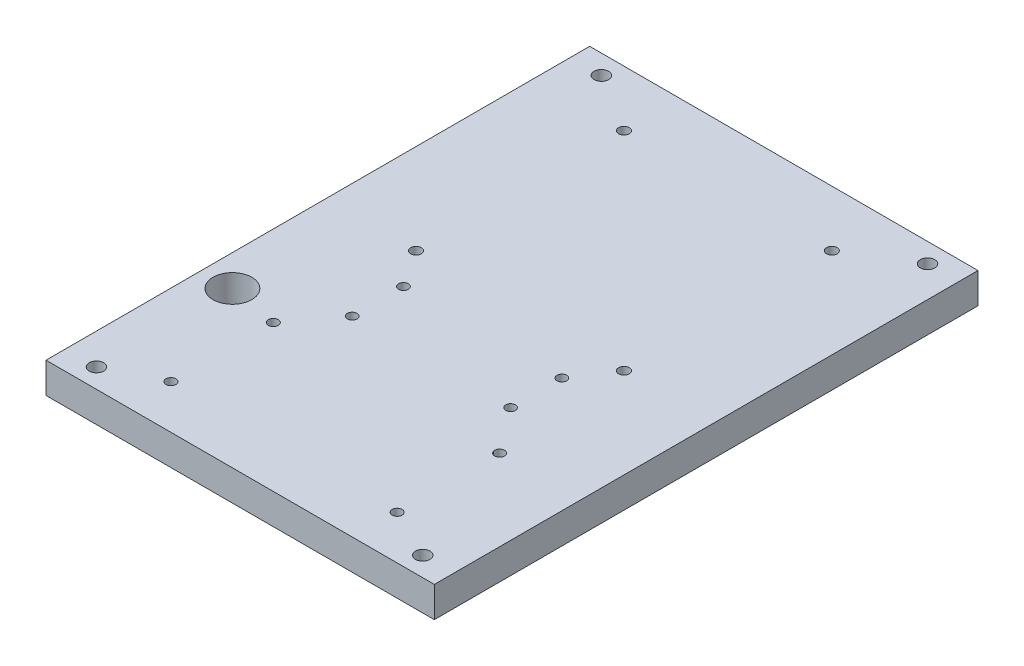
ISO-10303-21;
HEADER;
FILE_DESCRIPTION(('STEP AP214'),'2;1');
FILE_NAME('part.step','',(''),(''),'','','');
FILE_SCHEMA(('AUTOMOTIVE_DESIGN { 1 0 10303 214 1 1 1 1 }'));
ENDSEC;
DATA;
#1=APPLICATION_CONTEXT('core data for automotive mechanical design processes');
#2=APPLICATION_PROTOCOL_DEFINITION('international standard','automotive_design',2000,#1);
#3=PRODUCT_CONTEXT('',#1,'mechanical');
#4=PRODUCT('Part','Part','',(#3));
#5=PRODUCT_RELATED_PRODUCT_CATEGORY('part','',(#4));
#6=PRODUCT_DEFINITION_FORMATION('','',#4);
#7=PRODUCT_DEFINITION_CONTEXT('part definition',#1,'design');
#8=PRODUCT_DEFINITION('design','',#6,#7);
#9=PRODUCT_DEFINITION_SHAPE('','',#8);
#10=(LENGTH_UNIT() NAMED_UNIT(*) SI_UNIT(.MILLI.,.METRE.));
#11=(NAMED_UNIT(*) PLANE_ANGLE_UNIT() SI_UNIT($,.RADIAN.));
#12=(NAMED_UNIT(*) SI_UNIT($,.STERADIAN.) SOLID_ANGLE_UNIT());
#13=UNCERTAINTY_MEASURE_WITH_UNIT(LENGTH_MEASURE(1.E-05),#10,'distance_accuracy_value','');
#14=(GEOMETRIC_REPRESENTATION_CONTEXT(3) GLOBAL_UNCERTAINTY_ASSIGNED_CONTEXT((#13)) GLOBAL_UNIT_ASSIGNED_CONTEXT((#10,
#11,#12)) REPRESENTATION_CONTEXT('',''));
#15=CARTESIAN_POINT('',(0.,0.,0.));
#16=DIRECTION('',(0.,0.,1.));
#17=DIRECTION('',(1.,0.,0.));
#18=AXIS2_PLACEMENT_3D('',#15,#16,#17);
#19=CARTESIAN_POINT('',(0.,10.,0.));
#20=DIRECTION('',(0.,1.,0.));
#21=DIRECTION('',(0.,0.,1.));
#22=AXIS2_PLACEMENT_3D('',#19,#20,#21);
#23=PLANE('',#22);
#24=CARTESIAN_POINT('',(25.908,10.,9.5937055453349));
#25=DIRECTION('',(0.,1.,0.));
#26=DIRECTION('',(0.,0.,1.));
#27=AXIS2_PLACEMENT_3D('',#24,#25,#26);
#28=CIRCLE('',#27,1.5875);
#29=CARTESIAN_POINT('',(25.908,10.,11.1812055453349));
#30=VERTEX_POINT('',#29);
#31=EDGE_CURVE('E207',#30,#30,#28,.T.);
#32=ORIENTED_EDGE('',*,*,#31,.F.);
#33=EDGE_LOOP('',(#32));
#34=FACE_BOUND('',#33,.T.);
#35=CARTESIAN_POINT('',(25.908,10.,26.3577055453349));
#36=DIRECTION('',(0.,1.,0.));
#37=DIRECTION('',(0.,0.,1.));
#38=AXIS2_PLACEMENT_3D('',#35,#36,#37);
#39=CIRCLE('',#38,1.5875);
#40=CARTESIAN_POINT('',(25.908,10.,27.9452055453349));
#41=VERTEX_POINT('',#40);
#42=EDGE_CURVE('E201',#41,#41,#39,.T.);
#43=ORIENTED_EDGE('',*,*,#42,.F.);
#44=EDGE_LOOP('',(#43));
#45=FACE_BOUND('',#44,.T.);
#46=CARTESIAN_POINT('',(-25.908,10.,26.3577055453349));
#47=DIRECTION('',(0.,1.,0.));
#48=DIRECTION('',(0.,0.,1.));
#49=AXIS2_PLACEMENT_3D('',#46,#47,#48);
#50=CIRCLE('',#49,1.58750000000001);
#51=CARTESIAN_POINT('',(-25.908,10.,27.9452055453349));
#52=VERTEX_POINT('',#51);
#53=EDGE_CURVE('E195',#52,#52,#50,.T.);
#54=ORIENTED_EDGE('',*,*,#53,.F.);
#55=EDGE_LOOP('',(#54));
#56=FACE_BOUND('',#55,.T.);
#57=CARTESIAN_POINT('',(-25.908,10.,9.5937055453349));
#58=DIRECTION('',(0.,1.,0.));
#59=DIRECTION('',(0.,0.,1.));
#60=AXIS2_PLACEMENT_3D('',#57,#58,#59);
#61=CIRCLE('',#60,1.58750000000001);
#62=CARTESIAN_POINT('',(-25.908,10.,11.1812055453349));
#63=VERTEX_POINT('',#62);
#64=EDGE_CURVE('E192',#63,#63,#61,.T.);
#65=ORIENTED_EDGE('',*,*,#64,.F.);
#66=EDGE_LOOP('',(#65));
#67=FACE_BOUND('',#66,.T.);
#68=CARTESIAN_POINT('',(-34.,10.,-2.60371481104785));
#69=DIRECTION('',(0.,1.,0.));
#70=DIRECTION('',(0.,0.,1.));
#71=AXIS2_PLACEMENT_3D('',#68,#69,#70);
#72=CIRCLE('',#71,1.75000000000001);
#73=CARTESIAN_POINT('',(-34.,10.,-0.853714811047836));
#74=VERTEX_POINT('',#73);
#75=EDGE_CURVE('E186',#74,#74,#72,.T.);
#76=ORIENTED_EDGE('',*,*,#75,.F.);
#77=EDGE_LOOP('',(#76));
#78=FACE_BOUND('',#77,.T.);
#79=CARTESIAN_POINT('',(34.,10.,-2.60371481104786));
#80=DIRECTION('',(0.,1.,0.));
#81=DIRECTION('',(0.,0.,1.));
#82=AXIS2_PLACEMENT_3D('',#79,#80,#81);
#83=CIRCLE('',#82,1.75000000000001);
#84=CARTESIAN_POINT('',(34.,10.,-0.85371481104785));
#85=VERTEX_POINT('',#84);
#86=EDGE_CURVE('E180',#85,#85,#83,.T.);
#87=ORIENTED_EDGE('',*,*,#86,.F.);
#88=EDGE_LOOP('',(#87));
#89=FACE_BOUND('',#88,.T.);
#90=CARTESIAN_POINT('',(-34.,10.,-70.6037148110478));
#91=DIRECTION('',(0.,1.,0.));
#92=DIRECTION('',(0.,0.,1.));
#93=AXIS2_PLACEMENT_3D('',#90,#91,#92);
#94=CIRCLE('',#93,1.75000000000001);
#95=CARTESIAN_POINT('',(-34.,10.,-68.8537148110478));
#96=VERTEX_POINT('',#95);
#97=EDGE_CURVE('E174',#96,#96,#94,.T.);
#98=ORIENTED_EDGE('',*,*,#97,.F.);
#99=EDGE_LOOP('',(#98));
#100=FACE_BOUND('',#99,.T.);
#101=CARTESIAN_POINT('',(34.,10.,-70.6037148110478));
#102=DIRECTION('',(0.,1.,0.));
#103=DIRECTION('',(0.,0.,1.));
#104=AXIS2_PLACEMENT_3D('',#101,#102,#103);
#105=CIRCLE('',#104,1.75000000000001);
#106=CARTESIAN_POINT('',(34.,10.,-68.8537148110478));
#107=VERTEX_POINT('',#106);
#108=EDGE_CURVE('E168',#107,#107,#105,.T.);
#109=ORIENTED_EDGE('',*,*,#108,.F.);
#110=EDGE_LOOP('',(#109));
#111=FACE_BOUND('',#110,.T.);
#112=CARTESIAN_POINT('',(37.,10.,41.0497834995753));
#113=DIRECTION('',(0.,1.,0.));
#114=DIRECTION('',(0.,0.,1.));
#115=AXIS2_PLACEMENT_3D('',#112,#113,#114);
#116=CIRCLE('',#115,1.62500000000003);
#117=CARTESIAN_POINT('',(37.,10.,42.6747834995753));
#118=VERTEX_POINT('',#117);
#119=EDGE_CURVE('E162',#118,#118,#116,.T.);
#120=ORIENTED_EDGE('',*,*,#119,.F.);
#121=EDGE_LOOP('',(#120));
#122=FACE_BOUND('',#121,.T.);
#123=CARTESIAN_POINT('',(-37.,10.,41.0497834995753));
#124=DIRECTION('',(0.,1.,0.));
#125=DIRECTION('',(0.,0.,1.));
#126=AXIS2_PLACEMENT_3D('',#123,#124,#125);
#127=CIRCLE('',#126,1.625);
#128=CARTESIAN_POINT('',(-37.,10.,42.6747834995753));
#129=VERTEX_POINT('',#128);
#130=EDGE_CURVE('E156',#129,#129,#127,.T.);
#131=ORIENTED_EDGE('',*,*,#130,.F.);
#132=EDGE_LOOP('',(#131));
#133=FACE_BOUND('',#132,.T.);
#134=CARTESIAN_POINT('',(-37.,10.,74.5497834995753));
#135=DIRECTION('',(0.,1.,0.));
#136=DIRECTION('',(0.,0.,1.));
#137=AXIS2_PLACEMENT_3D('',#134,#135,#136);
#138=CIRCLE('',#137,1.625);
#139=CARTESIAN_POINT('',(-37.,10.,76.1747834995753));
#140=VERTEX_POINT('',#139);
#141=EDGE_CURVE('E150',#140,#140,#138,.T.);
#142=ORIENTED_EDGE('',*,*,#141,.F.);
#143=EDGE_LOOP('',(#142));
#144=FACE_BOUND('',#143,.T.);
#145=CARTESIAN_POINT('',(37.,10.,74.5497834995753));
#146=DIRECTION('',(0.,1.,0.));
#147=DIRECTION('',(0.,0.,1.));
#148=AXIS2_PLACEMENT_3D('',#145,#146,#147);
#149=CIRCLE('',#148,1.625);
#150=CARTESIAN_POINT('',(37.,10.,76.1747834995753));
#151=VERTEX_POINT('',#150);
#152=EDGE_CURVE('E144',#151,#151,#149,.T.);
#153=ORIENTED_EDGE('',*,*,#152,.F.);
#154=EDGE_LOOP('',(#153));
#155=FACE_BOUND('',#154,.T.);
#156=CARTESIAN_POINT('',(-53.34,10.,82.55));
#157=DIRECTION('',(0.,1.,0.));
#158=DIRECTION('',(0.,0.,1.));
#159=AXIS2_PLACEMENT_3D('',#156,#157,#158);
#160=CIRCLE('',#159,2.37490000000001);
#161=CARTESIAN_POINT('',(-53.34,10.,84.9249));
#162=VERTEX_POINT('',#161);
#163=EDGE_CURVE('E129',#162,#162,#160,.T.);
#164=ORIENTED_EDGE('',*,*,#163,.F.);
#165=EDGE_LOOP('',(#164));
#166=FACE_BOUND('',#165,.T.);
#167=CARTESIAN_POINT('',(53.34,10.,-82.55));
#168=DIRECTION('',(0.,1.,0.));
#169=DIRECTION('',(0.,0.,1.));
#170=AXIS2_PLACEMENT_3D('',#167,#168,#169);
#171=CIRCLE('',#170,2.37490000000005);
#172=CARTESIAN_POINT('',(53.34,10.,-80.1751));
#173=VERTEX_POINT('',#172);
#174=EDGE_CURVE('E117',#173,#173,#171,.T.);
#175=ORIENTED_EDGE('',*,*,#174,.F.);
#176=EDGE_LOOP('',(#175));
#177=FACE_BOUND('',#176,.T.);
#178=DIRECTION('',(0.,0.,1.));
#179=VECTOR('',#178,1.);
#180=CARTESIAN_POINT('',(-63.5,10.,88.9));
#181=LINE('',#180,#179);
#182=CARTESIAN_POINT('',(-63.5,10.,-88.9));
#183=VERTEX_POINT('',#182);
#184=CARTESIAN_POINT('',(-63.5,10.,88.9));
#185=VERTEX_POINT('',#184);
#186=EDGE_CURVE('E87',#183,#185,#181,.T.);
#187=ORIENTED_EDGE('',*,*,#186,.T.);
#188=DIRECTION('',(1.,0.,0.));
#189=VECTOR('',#188,1.);
#190=CARTESIAN_POINT('',(63.5,10.,88.9));
#191=LINE('',#190,#189);
#192=CARTESIAN_POINT('',(63.5,10.,88.9));
#193=VERTEX_POINT('',#192);
#194=EDGE_CURVE('E82',#185,#193,#191,.T.);
#195=ORIENTED_EDGE('',*,*,#194,.T.);
#196=DIRECTION('',(0.,0.,-1.));
#197=VECTOR('',#196,1.);
#198=CARTESIAN_POINT('',(63.5,10.,88.9));
#199=LINE('',#198,#197);
#200=CARTESIAN_POINT('',(63.5,10.,-88.9));
#201=VERTEX_POINT('',#200);
#202=EDGE_CURVE('E85',#193,#201,#199,.T.);
#203=ORIENTED_EDGE('',*,*,#202,.T.);
#204=DIRECTION('',(-1.,0.,0.));
#205=VECTOR('',#204,1.);
#206=CARTESIAN_POINT('',(63.5,10.,-88.9));
#207=LINE('',#206,#205);
#208=EDGE_CURVE('E52',#201,#183,#207,.T.);
#209=ORIENTED_EDGE('',*,*,#208,.T.);
#210=EDGE_LOOP('',(#187,#195,#203,#209));
#211=FACE_BOUND('',#210,.T.);
#212=CARTESIAN_POINT('',(-53.34,10.,-82.55));
#213=DIRECTION('',(0.,1.,0.));
#214=DIRECTION('',(0.,0.,1.));
#215=AXIS2_PLACEMENT_3D('',#212,#213,#214);
#216=CIRCLE('',#215,2.37490000000002);
#217=CARTESIAN_POINT('',(-53.34,10.,-80.1751));
#218=VERTEX_POINT('',#217);
#219=EDGE_CURVE('E102',#218,#218,#216,.T.);
#220=ORIENTED_EDGE('',*,*,#219,.F.);
#221=EDGE_LOOP('',(#220));
#222=FACE_BOUND('',#221,.T.);
#223=CARTESIAN_POINT('',(53.34,10.,82.55));
#224=DIRECTION('',(0.,1.,0.));
#225=DIRECTION('',(0.,0.,1.));
#226=AXIS2_PLACEMENT_3D('',#223,#224,#225);
#227=CIRCLE('',#226,2.37490000000002);
#228=CARTESIAN_POINT('',(53.34,10.,84.9249));
#229=VERTEX_POINT('',#228);
#230=EDGE_CURVE('E123',#229,#229,#227,.T.);
#231=ORIENTED_EDGE('',*,*,#230,.F.);
#232=EDGE_LOOP('',(#231));
#233=FACE_BOUND('',#232,.T.);
#234=CARTESIAN_POINT('',(-53.34,10.,38.1));
#235=DIRECTION('',(0.,1.,0.));
#236=DIRECTION('',(0.,0.,1.));
#237=AXIS2_PLACEMENT_3D('',#234,#235,#236);
#238=CIRCLE('',#237,6.35);
#239=CARTESIAN_POINT('',(-53.34,10.,44.45));
#240=VERTEX_POINT('',#239);
#241=EDGE_CURVE('E135',#240,#240,#238,.T.);
#242=ORIENTED_EDGE('',*,*,#241,.F.);
#243=EDGE_LOOP('',(#242));
#244=FACE_BOUND('',#243,.T.);
#245=ADVANCED_FACE('F35',(#34,#45,#56,#67,#78,#89,#100,#111,#122,#133,#144,#155,#166,#177,#211,
#222,#233,#244),#23,.T.);
#246=CARTESIAN_POINT('',(0.,0.,0.));
#247=DIRECTION('',(0.,1.,0.));
#248=DIRECTION('',(0.,0.,1.));
#249=AXIS2_PLACEMENT_3D('',#246,#247,#248);
#250=PLANE('',#249);
#251=CARTESIAN_POINT('',(25.908,0.,9.5937055453349));
#252=DIRECTION('',(0.,1.,0.));
#253=DIRECTION('',(0.,0.,1.));
#254=AXIS2_PLACEMENT_3D('',#251,#252,#253);
#255=CIRCLE('',#254,1.5875);
#256=CARTESIAN_POINT('',(25.908,0.,11.1812055453349));
#257=VERTEX_POINT('',#256);
#258=EDGE_CURVE('E210',#257,#257,#255,.T.);
#259=ORIENTED_EDGE('',*,*,#258,.T.);
#260=EDGE_LOOP('',(#259));
#261=FACE_BOUND('',#260,.T.);
#262=CARTESIAN_POINT('',(25.908,0.,26.3577055453349));
#263=DIRECTION('',(0.,1.,0.));
#264=DIRECTION('',(0.,0.,1.));
#265=AXIS2_PLACEMENT_3D('',#262,#263,#264);
#266=CIRCLE('',#265,1.5875);
#267=CARTESIAN_POINT('',(25.908,0.,27.9452055453349));
#268=VERTEX_POINT('',#267);
#269=EDGE_CURVE('E204',#268,#268,#266,.T.);
#270=ORIENTED_EDGE('',*,*,#269,.T.);
#271=EDGE_LOOP('',(#270));
#272=FACE_BOUND('',#271,.T.);
#273=CARTESIAN_POINT('',(-25.908,0.,26.3577055453349));
#274=DIRECTION('',(0.,1.,0.));
#275=DIRECTION('',(0.,0.,1.));
#276=AXIS2_PLACEMENT_3D('',#273,#274,#275);
#277=CIRCLE('',#276,1.58750000000001);
#278=CARTESIAN_POINT('',(-25.908,0.,27.9452055453349));
#279=VERTEX_POINT('',#278);
#280=EDGE_CURVE('E198',#279,#279,#277,.T.);
#281=ORIENTED_EDGE('',*,*,#280,.T.);
#282=EDGE_LOOP('',(#281));
#283=FACE_BOUND('',#282,.T.);
#284=CARTESIAN_POINT('',(-25.908,0.,9.5937055453349));
#285=DIRECTION('',(0.,1.,0.));
#286=DIRECTION('',(0.,0.,1.));
#287=AXIS2_PLACEMENT_3D('',#284,#285,#286);
#288=CIRCLE('',#287,1.58750000000001);
#289=CARTESIAN_POINT('',(-25.908,0.,11.1812055453349));
#290=VERTEX_POINT('',#289);
#291=EDGE_CURVE('E189',#290,#290,#288,.T.);
#292=ORIENTED_EDGE('',*,*,#291,.T.);
#293=EDGE_LOOP('',(#292));
#294=FACE_BOUND('',#293,.T.);
#295=CARTESIAN_POINT('',(-34.,0.,-2.60371481104785));
#296=DIRECTION('',(0.,1.,0.));
#297=DIRECTION('',(0.,0.,1.));
#298=AXIS2_PLACEMENT_3D('',#295,#296,#297);
#299=CIRCLE('',#298,1.75000000000001);
#300=CARTESIAN_POINT('',(-34.,0.,-0.853714811047836));
#301=VERTEX_POINT('',#300);
#302=EDGE_CURVE('E183',#301,#301,#299,.T.);
#303=ORIENTED_EDGE('',*,*,#302,.T.);
#304=EDGE_LOOP('',(#303));
#305=FACE_BOUND('',#304,.T.);
#306=CARTESIAN_POINT('',(34.,0.,-2.60371481104786));
#307=DIRECTION('',(0.,1.,0.));
#308=DIRECTION('',(0.,0.,1.));
#309=AXIS2_PLACEMENT_3D('',#306,#307,#308);
#310=CIRCLE('',#309,1.75000000000001);
#311=CARTESIAN_POINT('',(34.,0.,-0.85371481104785));
#312=VERTEX_POINT('',#311);
#313=EDGE_CURVE('E177',#312,#312,#310,.T.);
#314=ORIENTED_EDGE('',*,*,#313,.T.);
#315=EDGE_LOOP('',(#314));
#316=FACE_BOUND('',#315,.T.);
#317=CARTESIAN_POINT('',(-34.,0.,-70.6037148110478));
#318=DIRECTION('',(0.,1.,0.));
#319=DIRECTION('',(0.,0.,1.));
#320=AXIS2_PLACEMENT_3D('',#317,#318,#319);
#321=CIRCLE('',#320,1.75000000000001);
#322=CARTESIAN_POINT('',(-34.,0.,-68.8537148110478));
#323=VERTEX_POINT('',#322);
#324=EDGE_CURVE('E171',#323,#323,#321,.T.);
#325=ORIENTED_EDGE('',*,*,#324,.T.);
#326=EDGE_LOOP('',(#325));
#327=FACE_BOUND('',#326,.T.);
#328=CARTESIAN_POINT('',(34.,0.,-70.6037148110478));
#329=DIRECTION('',(0.,1.,0.));
#330=DIRECTION('',(0.,0.,1.));
#331=AXIS2_PLACEMENT_3D('',#328,#329,#330);
#332=CIRCLE('',#331,1.75000000000001);
#333=CARTESIAN_POINT('',(34.,0.,-68.8537148110478));
#334=VERTEX_POINT('',#333);
#335=EDGE_CURVE('E165',#334,#334,#332,.T.);
#336=ORIENTED_EDGE('',*,*,#335,.T.);
#337=EDGE_LOOP('',(#336));
#338=FACE_BOUND('',#337,.T.);
#339=CARTESIAN_POINT('',(37.,0.,41.0497834995753));
#340=DIRECTION('',(0.,1.,0.));
#341=DIRECTION('',(0.,0.,1.));
#342=AXIS2_PLACEMENT_3D('',#339,#340,#341);
#343=CIRCLE('',#342,1.62500000000003);
#344=CARTESIAN_POINT('',(37.,0.,42.6747834995753));
#345=VERTEX_POINT('',#344);
#346=EDGE_CURVE('E159',#345,#345,#343,.T.);
#347=ORIENTED_EDGE('',*,*,#346,.T.);
#348=EDGE_LOOP('',(#347));
#349=FACE_BOUND('',#348,.T.);
#350=CARTESIAN_POINT('',(-37.,0.,41.0497834995753));
#351=DIRECTION('',(0.,1.,0.));
#352=DIRECTION('',(0.,0.,1.));
#353=AXIS2_PLACEMENT_3D('',#350,#351,#352);
#354=CIRCLE('',#353,1.625);
#355=CARTESIAN_POINT('',(-37.,0.,42.6747834995753));
#356=VERTEX_POINT('',#355);
#357=EDGE_CURVE('E153',#356,#356,#354,.T.);
#358=ORIENTED_EDGE('',*,*,#357,.T.);
#359=EDGE_LOOP('',(#358));
#360=FACE_BOUND('',#359,.T.);
#361=CARTESIAN_POINT('',(-37.,0.,74.5497834995753));
#362=DIRECTION('',(0.,1.,0.));
#363=DIRECTION('',(0.,0.,1.));
#364=AXIS2_PLACEMENT_3D('',#361,#362,#363);
#365=CIRCLE('',#364,1.625);
#366=CARTESIAN_POINT('',(-37.,0.,76.1747834995753));
#367=VERTEX_POINT('',#366);
#368=EDGE_CURVE('E147',#367,#367,#365,.T.);
#369=ORIENTED_EDGE('',*,*,#368,.T.);
#370=EDGE_LOOP('',(#369));
#371=FACE_BOUND('',#370,.T.);
#372=CARTESIAN_POINT('',(37.,0.,74.5497834995753));
#373=DIRECTION('',(0.,1.,0.));
#374=DIRECTION('',(0.,0.,1.));
#375=AXIS2_PLACEMENT_3D('',#372,#373,#374);
#376=CIRCLE('',#375,1.625);
#377=CARTESIAN_POINT('',(37.,0.,76.1747834995753));
#378=VERTEX_POINT('',#377);
#379=EDGE_CURVE('E141',#378,#378,#376,.T.);
#380=ORIENTED_EDGE('',*,*,#379,.T.);
#381=EDGE_LOOP('',(#380));
#382=FACE_BOUND('',#381,.T.);
#383=CARTESIAN_POINT('',(-53.34,0.,82.55));
#384=DIRECTION('',(0.,1.,0.));
#385=DIRECTION('',(0.,0.,1.));
#386=AXIS2_PLACEMENT_3D('',#383,#384,#385);
#387=CIRCLE('',#386,2.37490000000001);
#388=CARTESIAN_POINT('',(-53.34,0.,84.9249));
#389=VERTEX_POINT('',#388);
#390=EDGE_CURVE('E132',#389,#389,#387,.T.);
#391=ORIENTED_EDGE('',*,*,#390,.T.);
#392=EDGE_LOOP('',(#391));
#393=FACE_BOUND('',#392,.T.);
#394=CARTESIAN_POINT('',(53.34,0.,-82.55));
#395=DIRECTION('',(0.,1.,0.));
#396=DIRECTION('',(0.,0.,1.));
#397=AXIS2_PLACEMENT_3D('',#394,#395,#396);
#398=CIRCLE('',#397,2.37490000000005);
#399=CARTESIAN_POINT('',(53.34,0.,-80.1751));
#400=VERTEX_POINT('',#399);
#401=EDGE_CURVE('E120',#400,#400,#398,.T.);
#402=ORIENTED_EDGE('',*,*,#401,.T.);
#403=EDGE_LOOP('',(#402));
#404=FACE_BOUND('',#403,.T.);
#405=DIRECTION('',(0.,0.,1.));
#406=VECTOR('',#405,1.);
#407=CARTESIAN_POINT('',(-63.5,0.,88.9));
#408=LINE('',#407,#406);
#409=CARTESIAN_POINT('',(-63.5,0.,-88.9));
#410=VERTEX_POINT('',#409);
#411=CARTESIAN_POINT('',(-63.5,0.,88.9));
#412=VERTEX_POINT('',#411);
#413=EDGE_CURVE('E99',#410,#412,#408,.T.);
#414=ORIENTED_EDGE('',*,*,#413,.F.);
#415=DIRECTION('',(-1.,0.,0.));
#416=VECTOR('',#415,1.);
#417=CARTESIAN_POINT('',(63.5,0.,-88.9));
#418=LINE('',#417,#416);
#419=CARTESIAN_POINT('',(63.5,0.,-88.9));
#420=VERTEX_POINT('',#419);
#421=EDGE_CURVE('E75',#420,#410,#418,.T.);
#422=ORIENTED_EDGE('',*,*,#421,.F.);
#423=DIRECTION('',(0.,0.,-1.));
#424=VECTOR('',#423,1.);
#425=CARTESIAN_POINT('',(63.5,0.,88.9));
#426=LINE('',#425,#424);
#427=CARTESIAN_POINT('',(63.5,0.,88.9));
#428=VERTEX_POINT('',#427);
#429=EDGE_CURVE('E69',#428,#420,#426,.T.);
#430=ORIENTED_EDGE('',*,*,#429,.F.);
#431=DIRECTION('',(1.,0.,0.));
#432=VECTOR('',#431,1.);
#433=CARTESIAN_POINT('',(63.5,0.,88.9));
#434=LINE('',#433,#432);
#435=EDGE_CURVE('E91',#412,#428,#434,.T.);
#436=ORIENTED_EDGE('',*,*,#435,.F.);
#437=EDGE_LOOP('',(#414,#422,#430,#436));
#438=FACE_BOUND('',#437,.T.);
#439=CARTESIAN_POINT('',(-53.34,0.,-82.55));
#440=DIRECTION('',(0.,1.,0.));
#441=DIRECTION('',(0.,0.,1.));
#442=AXIS2_PLACEMENT_3D('',#439,#440,#441);
#443=CIRCLE('',#442,2.37490000000002);
#444=CARTESIAN_POINT('',(-53.34,0.,-80.1751));
#445=VERTEX_POINT('',#444);
#446=EDGE_CURVE('E114',#445,#445,#443,.T.);
#447=ORIENTED_EDGE('',*,*,#446,.T.);
#448=EDGE_LOOP('',(#447));
#449=FACE_BOUND('',#448,.T.);
#450=CARTESIAN_POINT('',(53.34,0.,82.55));
#451=DIRECTION('',(0.,1.,0.));
#452=DIRECTION('',(0.,0.,1.));
#453=AXIS2_PLACEMENT_3D('',#450,#451,#452);
#454=CIRCLE('',#453,2.37490000000002);
#455=CARTESIAN_POINT('',(53.34,0.,84.9249));
#456=VERTEX_POINT('',#455);
#457=EDGE_CURVE('E126',#456,#456,#454,.T.);
#458=ORIENTED_EDGE('',*,*,#457,.T.);
#459=EDGE_LOOP('',(#458));
#460=FACE_BOUND('',#459,.T.);
#461=CARTESIAN_POINT('',(-53.34,0.,38.1));
#462=DIRECTION('',(0.,1.,0.));
#463=DIRECTION('',(0.,0.,1.));
#464=AXIS2_PLACEMENT_3D('',#461,#462,#463);
#465=CIRCLE('',#464,6.35);
#466=CARTESIAN_POINT('',(-53.34,0.,44.45));
#467=VERTEX_POINT('',#466);
#468=EDGE_CURVE('E138',#467,#467,#465,.T.);
#469=ORIENTED_EDGE('',*,*,#468,.T.);
#470=EDGE_LOOP('',(#469));
#471=FACE_BOUND('',#470,.T.);
#472=ADVANCED_FACE('F110',(#261,#272,#283,#294,#305,#316,#327,#338,#349,#360,#371,#382,#393,
#404,#438,#449,#460,#471),#250,.F.);
#473=CARTESIAN_POINT('',(-63.5,10.,88.9));
#474=DIRECTION('',(1.,0.,0.));
#475=DIRECTION('',(0.,0.,-1.));
#476=AXIS2_PLACEMENT_3D('',#473,#474,#475);
#477=PLANE('',#476);
#478=ORIENTED_EDGE('',*,*,#413,.T.);
#479=DIRECTION('',(0.,-1.,0.));
#480=VECTOR('',#479,1.);
#481=CARTESIAN_POINT('',(-63.5,10.,88.9));
#482=LINE('',#481,#480);
#483=EDGE_CURVE('E11',#185,#412,#482,.T.);
#484=ORIENTED_EDGE('',*,*,#483,.F.);
#485=ORIENTED_EDGE('',*,*,#186,.F.);
#486=DIRECTION('',(0.,-1.,0.));
#487=VECTOR('',#486,1.);
#488=CARTESIAN_POINT('',(-63.5,10.,-88.9));
#489=LINE('',#488,#487);
#490=EDGE_CURVE('E95',#183,#410,#489,.T.);
#491=ORIENTED_EDGE('',*,*,#490,.T.);
#492=EDGE_LOOP('',(#478,#484,#485,#491));
#493=FACE_BOUND('',#492,.T.);
#494=ADVANCED_FACE('F37',(#493),#477,.F.);
#495=CARTESIAN_POINT('',(63.5,10.,88.9));
#496=DIRECTION('',(0.,0.,-1.));
#497=DIRECTION('',(-1.,0.,0.));
#498=AXIS2_PLACEMENT_3D('',#495,#496,#497);
#499=PLANE('',#498);
#500=ORIENTED_EDGE('',*,*,#435,.T.);
#501=DIRECTION('',(0.,-1.,0.));
#502=VECTOR('',#501,1.);
#503=CARTESIAN_POINT('',(63.5,10.,88.9));
#504=LINE('',#503,#502);
#505=EDGE_CURVE('E44',#193,#428,#504,.T.);
#506=ORIENTED_EDGE('',*,*,#505,.F.);
#507=ORIENTED_EDGE('',*,*,#194,.F.);
#508=ORIENTED_EDGE('',*,*,#483,.T.);
#509=EDGE_LOOP('',(#500,#506,#507,#508));
#510=FACE_BOUND('',#509,.T.);
#511=ADVANCED_FACE('F90',(#510),#499,.F.);
#512=CARTESIAN_POINT('',(63.5,10.,88.9));
#513=DIRECTION('',(-1.,0.,0.));
#514=DIRECTION('',(0.,0.,1.));
#515=AXIS2_PLACEMENT_3D('',#512,#513,#514);
#516=PLANE('',#515);
#517=ORIENTED_EDGE('',*,*,#429,.T.);
#518=DIRECTION('',(0.,-1.,0.));
#519=VECTOR('',#518,1.);
#520=CARTESIAN_POINT('',(63.5,10.,-88.9));
#521=LINE('',#520,#519);
#522=EDGE_CURVE('E92',#201,#420,#521,.T.);
#523=ORIENTED_EDGE('',*,*,#522,.F.);
#524=ORIENTED_EDGE('',*,*,#202,.F.);
#525=ORIENTED_EDGE('',*,*,#505,.T.);
#526=EDGE_LOOP('',(#517,#523,#524,#525));
#527=FACE_BOUND('',#526,.T.);
#528=ADVANCED_FACE('F93',(#527),#516,.F.);
#529=CARTESIAN_POINT('',(63.5,10.,-88.9));
#530=DIRECTION('',(0.,0.,1.));
#531=DIRECTION('',(1.,0.,0.));
#532=AXIS2_PLACEMENT_3D('',#529,#530,#531);
#533=PLANE('',#532);
#534=ORIENTED_EDGE('',*,*,#421,.T.);
#535=ORIENTED_EDGE('',*,*,#490,.F.);
#536=ORIENTED_EDGE('',*,*,#208,.F.);
#537=ORIENTED_EDGE('',*,*,#522,.T.);
#538=EDGE_LOOP('',(#534,#535,#536,#537));
#539=FACE_BOUND('',#538,.T.);
#540=ADVANCED_FACE('F107',(#539),#533,.F.);
#541=CARTESIAN_POINT('',(-53.34,10.,-82.55));
#542=DIRECTION('',(0.,-1.,0.));
#543=DIRECTION('',(0.,0.,-1.));
#544=AXIS2_PLACEMENT_3D('',#541,#542,#543);
#545=CYLINDRICAL_SURFACE('',#544,2.37490000000002);
#546=ORIENTED_EDGE('',*,*,#219,.T.);
#547=EDGE_LOOP('',(#546));
#548=FACE_BOUND('',#547,.T.);
#549=ORIENTED_EDGE('',*,*,#446,.F.);
#550=EDGE_LOOP('',(#549));
#551=FACE_BOUND('',#550,.T.);
#552=ADVANCED_FACE('F251',(#548,#551),#545,.F.);
#553=CARTESIAN_POINT('',(53.34,10.,-82.55));
#554=DIRECTION('',(0.,-1.,0.));
#555=DIRECTION('',(0.,0.,-1.));
#556=AXIS2_PLACEMENT_3D('',#553,#554,#555);
#557=CYLINDRICAL_SURFACE('',#556,2.37490000000005);
#558=ORIENTED_EDGE('',*,*,#174,.T.);
#559=EDGE_LOOP('',(#558));
#560=FACE_BOUND('',#559,.T.);
#561=ORIENTED_EDGE('',*,*,#401,.F.);
#562=EDGE_LOOP('',(#561));
#563=FACE_BOUND('',#562,.T.);
#564=ADVANCED_FACE('F247',(#560,#563),#557,.F.);
#565=CARTESIAN_POINT('',(53.34,10.,82.55));
#566=DIRECTION('',(0.,-1.,0.));
#567=DIRECTION('',(0.,0.,-1.));
#568=AXIS2_PLACEMENT_3D('',#565,#566,#567);
#569=CYLINDRICAL_SURFACE('',#568,2.37490000000002);
#570=ORIENTED_EDGE('',*,*,#230,.T.);
#571=EDGE_LOOP('',(#570));
#572=FACE_BOUND('',#571,.T.);
#573=ORIENTED_EDGE('',*,*,#457,.F.);
#574=EDGE_LOOP('',(#573));
#575=FACE_BOUND('',#574,.T.);
#576=ADVANCED_FACE('F250',(#572,#575),#569,.F.);
#577=CARTESIAN_POINT('',(-53.34,10.,82.55));
#578=DIRECTION('',(0.,-1.,0.));
#579=DIRECTION('',(0.,0.,-1.));
#580=AXIS2_PLACEMENT_3D('',#577,#578,#579);
#581=CYLINDRICAL_SURFACE('',#580,2.37490000000001);
#582=ORIENTED_EDGE('',*,*,#163,.T.);
#583=EDGE_LOOP('',(#582));
#584=FACE_BOUND('',#583,.T.);
#585=ORIENTED_EDGE('',*,*,#390,.F.);
#586=EDGE_LOOP('',(#585));
#587=FACE_BOUND('',#586,.T.);
#588=ADVANCED_FACE('F296',(#584,#587),#581,.F.);
#589=CARTESIAN_POINT('',(-53.34,10.,38.1));
#590=DIRECTION('',(0.,-1.,0.));
#591=DIRECTION('',(0.,0.,-1.));
#592=AXIS2_PLACEMENT_3D('',#589,#590,#591);
#593=CYLINDRICAL_SURFACE('',#592,6.35);
#594=ORIENTED_EDGE('',*,*,#241,.T.);
#595=EDGE_LOOP('',(#594));
#596=FACE_BOUND('',#595,.T.);
#597=ORIENTED_EDGE('',*,*,#468,.F.);
#598=EDGE_LOOP('',(#597));
#599=FACE_BOUND('',#598,.T.);
#600=ADVANCED_FACE('F304',(#596,#599),#593,.F.);
#601=CARTESIAN_POINT('',(37.,0.,74.5497834995753));
#602=DIRECTION('',(0.,1.,0.));
#603=DIRECTION('',(0.,0.,1.));
#604=AXIS2_PLACEMENT_3D('',#601,#602,#603);
#605=CYLINDRICAL_SURFACE('',#604,1.625);
#606=ORIENTED_EDGE('',*,*,#379,.F.);
#607=EDGE_LOOP('',(#606));
#608=FACE_BOUND('',#607,.T.);
#609=ORIENTED_EDGE('',*,*,#152,.T.);
#610=EDGE_LOOP('',(#609));
#611=FACE_BOUND('',#610,.T.);
#612=ADVANCED_FACE('F312',(#608,#611),#605,.F.);
#613=CARTESIAN_POINT('',(-37.,0.,74.5497834995753));
#614=DIRECTION('',(0.,1.,0.));
#615=DIRECTION('',(0.,0.,1.));
#616=AXIS2_PLACEMENT_3D('',#613,#614,#615);
#617=CYLINDRICAL_SURFACE('',#616,1.625);
#618=ORIENTED_EDGE('',*,*,#368,.F.);
#619=EDGE_LOOP('',(#618));
#620=FACE_BOUND('',#619,.T.);
#621=ORIENTED_EDGE('',*,*,#141,.T.);
#622=EDGE_LOOP('',(#621));
#623=FACE_BOUND('',#622,.T.);
#624=ADVANCED_FACE('F320',(#620,#623),#617,.F.);
#625=CARTESIAN_POINT('',(-37.,0.,41.0497834995753));
#626=DIRECTION('',(0.,1.,0.));
#627=DIRECTION('',(0.,0.,1.));
#628=AXIS2_PLACEMENT_3D('',#625,#626,#627);
#629=CYLINDRICAL_SURFACE('',#628,1.625);
#630=ORIENTED_EDGE('',*,*,#357,.F.);
#631=EDGE_LOOP('',(#630));
#632=FACE_BOUND('',#631,.T.);
#633=ORIENTED_EDGE('',*,*,#130,.T.);
#634=EDGE_LOOP('',(#633));
#635=FACE_BOUND('',#634,.T.);
#636=ADVANCED_FACE('F328',(#632,#635),#629,.F.);
#637=CARTESIAN_POINT('',(37.,0.,41.0497834995753));
#638=DIRECTION('',(0.,1.,0.));
#639=DIRECTION('',(0.,0.,1.));
#640=AXIS2_PLACEMENT_3D('',#637,#638,#639);
#641=CYLINDRICAL_SURFACE('',#640,1.62500000000003);
#642=ORIENTED_EDGE('',*,*,#346,.F.);
#643=EDGE_LOOP('',(#642));
#644=FACE_BOUND('',#643,.T.);
#645=ORIENTED_EDGE('',*,*,#119,.T.);
#646=EDGE_LOOP('',(#645));
#647=FACE_BOUND('',#646,.T.);
#648=ADVANCED_FACE('F336',(#644,#647),#641,.F.);
#649=CARTESIAN_POINT('',(34.,0.,-70.6037148110478));
#650=DIRECTION('',(0.,1.,0.));
#651=DIRECTION('',(0.,0.,1.));
#652=AXIS2_PLACEMENT_3D('',#649,#650,#651);
#653=CYLINDRICAL_SURFACE('',#652,1.75000000000001);
#654=ORIENTED_EDGE('',*,*,#335,.F.);
#655=EDGE_LOOP('',(#654));
#656=FACE_BOUND('',#655,.T.);
#657=ORIENTED_EDGE('',*,*,#108,.T.);
#658=EDGE_LOOP('',(#657));
#659=FACE_BOUND('',#658,.T.);
#660=ADVANCED_FACE('F344',(#656,#659),#653,.F.);
#661=CARTESIAN_POINT('',(-34.,0.,-70.6037148110478));
#662=DIRECTION('',(0.,1.,0.));
#663=DIRECTION('',(0.,0.,1.));
#664=AXIS2_PLACEMENT_3D('',#661,#662,#663);
#665=CYLINDRICAL_SURFACE('',#664,1.75000000000001);
#666=ORIENTED_EDGE('',*,*,#324,.F.);
#667=EDGE_LOOP('',(#666));
#668=FACE_BOUND('',#667,.T.);
#669=ORIENTED_EDGE('',*,*,#97,.T.);
#670=EDGE_LOOP('',(#669));
#671=FACE_BOUND('',#670,.T.);
#672=ADVANCED_FACE('F352',(#668,#671),#665,.F.);
#673=CARTESIAN_POINT('',(34.,0.,-2.60371481104786));
#674=DIRECTION('',(0.,1.,0.));
#675=DIRECTION('',(0.,0.,1.));
#676=AXIS2_PLACEMENT_3D('',#673,#674,#675);
#677=CYLINDRICAL_SURFACE('',#676,1.75000000000001);
#678=ORIENTED_EDGE('',*,*,#313,.F.);
#679=EDGE_LOOP('',(#678));
#680=FACE_BOUND('',#679,.T.);
#681=ORIENTED_EDGE('',*,*,#86,.T.);
#682=EDGE_LOOP('',(#681));
#683=FACE_BOUND('',#682,.T.);
#684=ADVANCED_FACE('F360',(#680,#683),#677,.F.);
#685=CARTESIAN_POINT('',(-34.,0.,-2.60371481104785));
#686=DIRECTION('',(0.,1.,0.));
#687=DIRECTION('',(0.,0.,1.));
#688=AXIS2_PLACEMENT_3D('',#685,#686,#687);
#689=CYLINDRICAL_SURFACE('',#688,1.75000000000001);
#690=ORIENTED_EDGE('',*,*,#302,.F.);
#691=EDGE_LOOP('',(#690));
#692=FACE_BOUND('',#691,.T.);
#693=ORIENTED_EDGE('',*,*,#75,.T.);
#694=EDGE_LOOP('',(#693));
#695=FACE_BOUND('',#694,.T.);
#696=ADVANCED_FACE('F368',(#692,#695),#689,.F.);
#697=CARTESIAN_POINT('',(-25.908,0.,9.5937055453349));
#698=DIRECTION('',(0.,1.,0.));
#699=DIRECTION('',(0.,0.,1.));
#700=AXIS2_PLACEMENT_3D('',#697,#698,#699);
#701=CYLINDRICAL_SURFACE('',#700,1.58750000000001);
#702=ORIENTED_EDGE('',*,*,#291,.F.);
#703=EDGE_LOOP('',(#702));
#704=FACE_BOUND('',#703,.T.);
#705=ORIENTED_EDGE('',*,*,#64,.T.);
#706=EDGE_LOOP('',(#705));
#707=FACE_BOUND('',#706,.T.);
#708=ADVANCED_FACE('F376',(#704,#707),#701,.F.);
#709=CARTESIAN_POINT('',(-25.908,0.,26.3577055453349));
#710=DIRECTION('',(0.,1.,0.));
#711=DIRECTION('',(0.,0.,1.));
#712=AXIS2_PLACEMENT_3D('',#709,#710,#711);
#713=CYLINDRICAL_SURFACE('',#712,1.58750000000001);
#714=ORIENTED_EDGE('',*,*,#280,.F.);
#715=EDGE_LOOP('',(#714));
#716=FACE_BOUND('',#715,.T.);
#717=ORIENTED_EDGE('',*,*,#53,.T.);
#718=EDGE_LOOP('',(#717));
#719=FACE_BOUND('',#718,.T.);
#720=ADVANCED_FACE('F385',(#716,#719),#713,.F.);
#721=CARTESIAN_POINT('',(25.908,0.,26.3577055453349));
#722=DIRECTION('',(0.,1.,0.));
#723=DIRECTION('',(0.,0.,1.));
#724=AXIS2_PLACEMENT_3D('',#721,#722,#723);
#725=CYLINDRICAL_SURFACE('',#724,1.5875);
#726=ORIENTED_EDGE('',*,*,#269,.F.);
#727=EDGE_LOOP('',(#726));
#728=FACE_BOUND('',#727,.T.);
#729=ORIENTED_EDGE('',*,*,#42,.T.);
#730=EDGE_LOOP('',(#729));
#731=FACE_BOUND('',#730,.T.);
#732=ADVANCED_FACE('F393',(#728,#731),#725,.F.);
#733=CARTESIAN_POINT('',(25.908,0.,9.5937055453349));
#734=DIRECTION('',(0.,1.,0.));
#735=DIRECTION('',(0.,0.,1.));
#736=AXIS2_PLACEMENT_3D('',#733,#734,#735);
#737=CYLINDRICAL_SURFACE('',#736,1.5875);
#738=ORIENTED_EDGE('',*,*,#258,.F.);
#739=EDGE_LOOP('',(#738));
#740=FACE_BOUND('',#739,.T.);
#741=ORIENTED_EDGE('',*,*,#31,.T.);
#742=EDGE_LOOP('',(#741));
#743=FACE_BOUND('',#742,.T.);
#744=ADVANCED_FACE('F216',(#740,#743),#737,.F.);
#745=CLOSED_SHELL('',(#245,#472,#494,#511,#528,#540,#552,#564,#576,#588,#600,#612,#624,#636,
#648,#660,#672,#684,#696,#708,#720,#732,#744));
#746=MANIFOLD_SOLID_BREP('B2',#745);
#747=ADVANCED_BREP_SHAPE_REPRESENTATION('',(#18,#746),#14);
#748=SHAPE_DEFINITION_REPRESENTATION(#9,#747);
ENDSEC;
END-ISO-10303-21;
